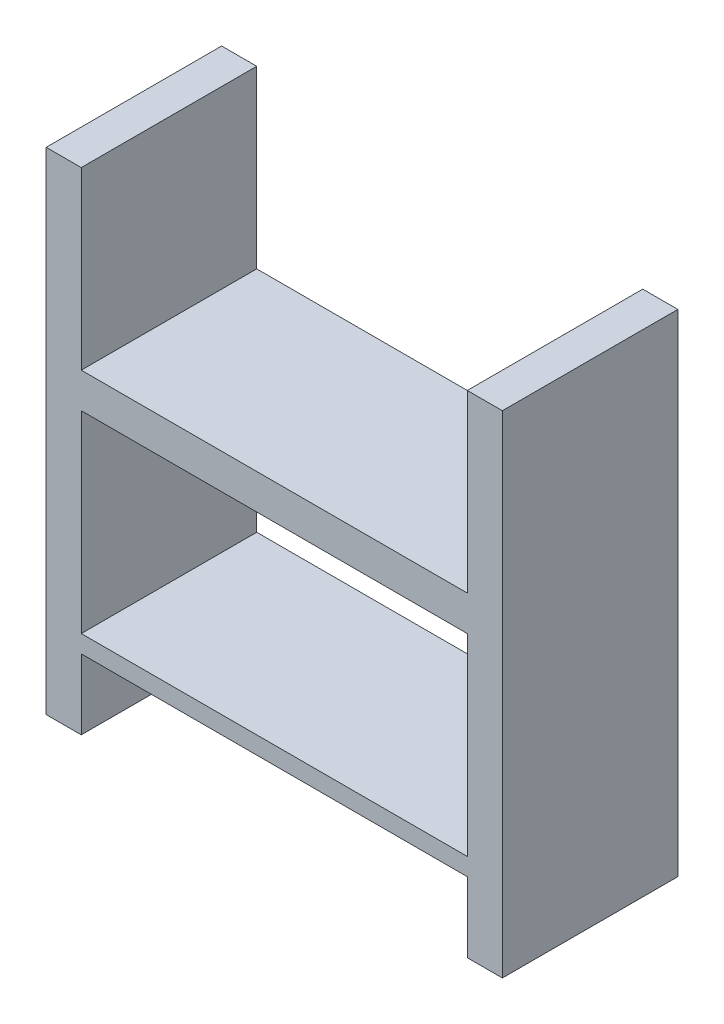
ISO-10303-21;
HEADER;
FILE_DESCRIPTION(('STEP AP214'),'2;1');
FILE_NAME('part.step','',(''),(''),'','','');
FILE_SCHEMA(('AUTOMOTIVE_DESIGN { 1 0 10303 214 1 1 1 1 }'));
ENDSEC;
DATA;
#1=APPLICATION_CONTEXT('core data for automotive mechanical design processes');
#2=APPLICATION_PROTOCOL_DEFINITION('international standard','automotive_design',2000,#1);
#3=PRODUCT_CONTEXT('',#1,'mechanical');
#4=PRODUCT('Part','Part','',(#3));
#5=PRODUCT_RELATED_PRODUCT_CATEGORY('part','',(#4));
#6=PRODUCT_DEFINITION_FORMATION('','',#4);
#7=PRODUCT_DEFINITION_CONTEXT('part definition',#1,'design');
#8=PRODUCT_DEFINITION('design','',#6,#7);
#9=PRODUCT_DEFINITION_SHAPE('','',#8);
#10=(LENGTH_UNIT() NAMED_UNIT(*) SI_UNIT(.MILLI.,.METRE.));
#11=(NAMED_UNIT(*) PLANE_ANGLE_UNIT() SI_UNIT($,.RADIAN.));
#12=(NAMED_UNIT(*) SI_UNIT($,.STERADIAN.) SOLID_ANGLE_UNIT());
#13=UNCERTAINTY_MEASURE_WITH_UNIT(LENGTH_MEASURE(1.E-05),#10,'distance_accuracy_value','');
#14=(GEOMETRIC_REPRESENTATION_CONTEXT(3) GLOBAL_UNCERTAINTY_ASSIGNED_CONTEXT((#13)) GLOBAL_UNIT_ASSIGNED_CONTEXT((#10,
#11,#12)) REPRESENTATION_CONTEXT('',''));
#15=CARTESIAN_POINT('',(0.,0.,0.));
#16=DIRECTION('',(0.,0.,1.));
#17=DIRECTION('',(1.,0.,0.));
#18=AXIS2_PLACEMENT_3D('',#15,#16,#17);
#19=CARTESIAN_POINT('',(55.,0.,50.));
#20=DIRECTION('',(-1.,0.,0.));
#21=DIRECTION('',(0.,0.,1.));
#22=AXIS2_PLACEMENT_3D('',#19,#20,#21);
#23=PLANE('',#22);
#24=DIRECTION('',(0.,1.,0.));
#25=VECTOR('',#24,1.);
#26=CARTESIAN_POINT('',(55.,0.,0.));
#27=LINE('',#26,#25);
#28=CARTESIAN_POINT('',(55.,-45.,0.));
#29=VERTEX_POINT('',#28);
#30=CARTESIAN_POINT('',(55.,-25.,0.));
#31=VERTEX_POINT('',#30);
#32=EDGE_CURVE('E275',#29,#31,#27,.T.);
#33=ORIENTED_EDGE('',*,*,#32,.F.);
#34=DIRECTION('',(0.,0.,-1.));
#35=VECTOR('',#34,1.);
#36=CARTESIAN_POINT('',(55.,-45.,50.));
#37=LINE('',#36,#35);
#38=CARTESIAN_POINT('',(55.,-45.,50.));
#39=VERTEX_POINT('',#38);
#40=EDGE_CURVE('E11',#39,#29,#37,.T.);
#41=ORIENTED_EDGE('',*,*,#40,.F.);
#42=DIRECTION('',(0.,1.,0.));
#43=VECTOR('',#42,1.);
#44=CARTESIAN_POINT('',(55.,0.,50.));
#45=LINE('',#44,#43);
#46=CARTESIAN_POINT('',(55.,-25.,50.));
#47=VERTEX_POINT('',#46);
#48=EDGE_CURVE('E322',#39,#47,#45,.T.);
#49=ORIENTED_EDGE('',*,*,#48,.T.);
#50=DIRECTION('',(0.,0.,-1.));
#51=VECTOR('',#50,1.);
#52=CARTESIAN_POINT('',(55.,-25.,50.));
#53=LINE('',#52,#51);
#54=EDGE_CURVE('E119',#47,#31,#53,.T.);
#55=ORIENTED_EDGE('',*,*,#54,.T.);
#56=EDGE_LOOP('',(#33,#41,#49,#55));
#57=FACE_BOUND('',#56,.T.);
#58=ADVANCED_FACE('F41',(#57),#23,.T.);
#59=CARTESIAN_POINT('',(0.,-45.,50.));
#60=DIRECTION('',(0.,1.,0.));
#61=DIRECTION('',(0.,0.,1.));
#62=AXIS2_PLACEMENT_3D('',#59,#60,#61);
#63=PLANE('',#62);
#64=DIRECTION('',(1.,0.,0.));
#65=VECTOR('',#64,1.);
#66=CARTESIAN_POINT('',(0.,-45.,0.));
#67=LINE('',#66,#65);
#68=CARTESIAN_POINT('',(65.,-45.,0.));
#69=VERTEX_POINT('',#68);
#70=EDGE_CURVE('E271',#29,#69,#67,.T.);
#71=ORIENTED_EDGE('',*,*,#70,.T.);
#72=DIRECTION('',(0.,0.,-1.));
#73=VECTOR('',#72,1.);
#74=CARTESIAN_POINT('',(65.,-45.,50.));
#75=LINE('',#74,#73);
#76=CARTESIAN_POINT('',(65.,-45.,50.));
#77=VERTEX_POINT('',#76);
#78=EDGE_CURVE('E52',#77,#69,#75,.T.);
#79=ORIENTED_EDGE('',*,*,#78,.F.);
#80=DIRECTION('',(1.,0.,0.));
#81=VECTOR('',#80,1.);
#82=CARTESIAN_POINT('',(0.,-45.,50.));
#83=LINE('',#82,#81);
#84=EDGE_CURVE('E319',#39,#77,#83,.T.);
#85=ORIENTED_EDGE('',*,*,#84,.F.);
#86=ORIENTED_EDGE('',*,*,#40,.T.);
#87=EDGE_LOOP('',(#71,#79,#85,#86));
#88=FACE_BOUND('',#87,.T.);
#89=ADVANCED_FACE('F357',(#88),#63,.F.);
#90=CARTESIAN_POINT('',(65.,0.,50.));
#91=DIRECTION('',(1.,0.,0.));
#92=DIRECTION('',(0.,0.,-1.));
#93=AXIS2_PLACEMENT_3D('',#90,#91,#92);
#94=PLANE('',#93);
#95=DIRECTION('',(0.,-1.,0.));
#96=VECTOR('',#95,1.);
#97=CARTESIAN_POINT('',(65.,0.,0.));
#98=LINE('',#97,#96);
#99=CARTESIAN_POINT('',(65.,95.,0.));
#100=VERTEX_POINT('',#99);
#101=EDGE_CURVE('E267',#100,#69,#98,.T.);
#102=ORIENTED_EDGE('',*,*,#101,.F.);
#103=DIRECTION('',(0.,0.,-1.));
#104=VECTOR('',#103,1.);
#105=CARTESIAN_POINT('',(65.,95.,50.));
#106=LINE('',#105,#104);
#107=CARTESIAN_POINT('',(65.,95.,50.));
#108=VERTEX_POINT('',#107);
#109=EDGE_CURVE('E214',#108,#100,#106,.T.);
#110=ORIENTED_EDGE('',*,*,#109,.F.);
#111=DIRECTION('',(0.,-1.,0.));
#112=VECTOR('',#111,1.);
#113=CARTESIAN_POINT('',(65.,0.,50.));
#114=LINE('',#113,#112);
#115=EDGE_CURVE('E315',#108,#77,#114,.T.);
#116=ORIENTED_EDGE('',*,*,#115,.T.);
#117=ORIENTED_EDGE('',*,*,#78,.T.);
#118=EDGE_LOOP('',(#102,#110,#116,#117));
#119=FACE_BOUND('',#118,.T.);
#120=ADVANCED_FACE('F362',(#119),#94,.T.);
#121=CARTESIAN_POINT('',(0.,95.,50.));
#122=DIRECTION('',(0.,1.,0.));
#123=DIRECTION('',(0.,0.,1.));
#124=AXIS2_PLACEMENT_3D('',#121,#122,#123);
#125=PLANE('',#124);
#126=DIRECTION('',(1.,0.,0.));
#127=VECTOR('',#126,1.);
#128=CARTESIAN_POINT('',(0.,95.,0.));
#129=LINE('',#128,#127);
#130=CARTESIAN_POINT('',(55.,95.,0.));
#131=VERTEX_POINT('',#130);
#132=EDGE_CURVE('E263',#131,#100,#129,.T.);
#133=ORIENTED_EDGE('',*,*,#132,.F.);
#134=DIRECTION('',(0.,0.,-1.));
#135=VECTOR('',#134,1.);
#136=CARTESIAN_POINT('',(55.,95.,50.));
#137=LINE('',#136,#135);
#138=CARTESIAN_POINT('',(55.,95.,50.));
#139=VERTEX_POINT('',#138);
#140=EDGE_CURVE('E211',#139,#131,#137,.T.);
#141=ORIENTED_EDGE('',*,*,#140,.F.);
#142=DIRECTION('',(1.,0.,0.));
#143=VECTOR('',#142,1.);
#144=CARTESIAN_POINT('',(0.,95.,50.));
#145=LINE('',#144,#143);
#146=EDGE_CURVE('E311',#139,#108,#145,.T.);
#147=ORIENTED_EDGE('',*,*,#146,.T.);
#148=ORIENTED_EDGE('',*,*,#109,.T.);
#149=EDGE_LOOP('',(#133,#141,#147,#148));
#150=FACE_BOUND('',#149,.T.);
#151=ADVANCED_FACE('F368',(#150),#125,.T.);
#152=CARTESIAN_POINT('',(55.,0.,50.));
#153=DIRECTION('',(-1.,0.,0.));
#154=DIRECTION('',(0.,-1.,0.));
#155=AXIS2_PLACEMENT_3D('',#152,#153,#154);
#156=PLANE('',#155);
#157=DIRECTION('',(0.,1.,0.));
#158=VECTOR('',#157,1.);
#159=CARTESIAN_POINT('',(55.,0.,0.));
#160=LINE('',#159,#158);
#161=CARTESIAN_POINT('',(55.,45.,0.));
#162=VERTEX_POINT('',#161);
#163=EDGE_CURVE('E259',#162,#131,#160,.T.);
#164=ORIENTED_EDGE('',*,*,#163,.F.);
#165=DIRECTION('',(0.,0.,-1.));
#166=VECTOR('',#165,1.);
#167=CARTESIAN_POINT('',(55.,45.,50.));
#168=LINE('',#167,#166);
#169=CARTESIAN_POINT('',(55.,45.,50.));
#170=VERTEX_POINT('',#169);
#171=EDGE_CURVE('E208',#170,#162,#168,.T.);
#172=ORIENTED_EDGE('',*,*,#171,.F.);
#173=DIRECTION('',(0.,1.,0.));
#174=VECTOR('',#173,1.);
#175=CARTESIAN_POINT('',(55.,0.,50.));
#176=LINE('',#175,#174);
#177=EDGE_CURVE('E307',#170,#139,#176,.T.);
#178=ORIENTED_EDGE('',*,*,#177,.T.);
#179=ORIENTED_EDGE('',*,*,#140,.T.);
#180=EDGE_LOOP('',(#164,#172,#178,#179));
#181=FACE_BOUND('',#180,.T.);
#182=ADVANCED_FACE('F372',(#181),#156,.T.);
#183=CARTESIAN_POINT('',(0.,45.,50.));
#184=DIRECTION('',(0.,1.,0.));
#185=DIRECTION('',(0.,0.,1.));
#186=AXIS2_PLACEMENT_3D('',#183,#184,#185);
#187=PLANE('',#186);
#188=DIRECTION('',(1.,0.,0.));
#189=VECTOR('',#188,1.);
#190=CARTESIAN_POINT('',(0.,45.,0.));
#191=LINE('',#190,#189);
#192=CARTESIAN_POINT('',(-55.,45.,0.));
#193=VERTEX_POINT('',#192);
#194=EDGE_CURVE('E255',#193,#162,#191,.T.);
#195=ORIENTED_EDGE('',*,*,#194,.F.);
#196=DIRECTION('',(0.,0.,-1.));
#197=VECTOR('',#196,1.);
#198=CARTESIAN_POINT('',(-55.,45.,50.));
#199=LINE('',#198,#197);
#200=CARTESIAN_POINT('',(-55.,45.,50.));
#201=VERTEX_POINT('',#200);
#202=EDGE_CURVE('E205',#201,#193,#199,.T.);
#203=ORIENTED_EDGE('',*,*,#202,.F.);
#204=DIRECTION('',(1.,0.,0.));
#205=VECTOR('',#204,1.);
#206=CARTESIAN_POINT('',(0.,45.,50.));
#207=LINE('',#206,#205);
#208=EDGE_CURVE('E303',#201,#170,#207,.T.);
#209=ORIENTED_EDGE('',*,*,#208,.T.);
#210=ORIENTED_EDGE('',*,*,#171,.T.);
#211=EDGE_LOOP('',(#195,#203,#209,#210));
#212=FACE_BOUND('',#211,.T.);
#213=ADVANCED_FACE('F376',(#212),#187,.T.);
#214=CARTESIAN_POINT('',(-55.,0.,50.));
#215=DIRECTION('',(-1.,0.,0.));
#216=DIRECTION('',(0.,0.,1.));
#217=AXIS2_PLACEMENT_3D('',#214,#215,#216);
#218=PLANE('',#217);
#219=DIRECTION('',(0.,1.,0.));
#220=VECTOR('',#219,1.);
#221=CARTESIAN_POINT('',(-55.,0.,0.));
#222=LINE('',#221,#220);
#223=CARTESIAN_POINT('',(-55.,95.,0.));
#224=VERTEX_POINT('',#223);
#225=EDGE_CURVE('E251',#193,#224,#222,.T.);
#226=ORIENTED_EDGE('',*,*,#225,.T.);
#227=DIRECTION('',(0.,0.,-1.));
#228=VECTOR('',#227,1.);
#229=CARTESIAN_POINT('',(-55.,95.,50.));
#230=LINE('',#229,#228);
#231=CARTESIAN_POINT('',(-55.,95.,50.));
#232=VERTEX_POINT('',#231);
#233=EDGE_CURVE('E202',#232,#224,#230,.T.);
#234=ORIENTED_EDGE('',*,*,#233,.F.);
#235=DIRECTION('',(0.,1.,0.));
#236=VECTOR('',#235,1.);
#237=CARTESIAN_POINT('',(-55.,0.,50.));
#238=LINE('',#237,#236);
#239=EDGE_CURVE('E300',#201,#232,#238,.T.);
#240=ORIENTED_EDGE('',*,*,#239,.F.);
#241=ORIENTED_EDGE('',*,*,#202,.T.);
#242=EDGE_LOOP('',(#226,#234,#240,#241));
#243=FACE_BOUND('',#242,.T.);
#244=ADVANCED_FACE('F380',(#243),#218,.F.);
#245=CARTESIAN_POINT('',(0.,95.,50.));
#246=DIRECTION('',(0.,1.,0.));
#247=DIRECTION('',(0.,0.,1.));
#248=AXIS2_PLACEMENT_3D('',#245,#246,#247);
#249=PLANE('',#248);
#250=DIRECTION('',(1.,0.,0.));
#251=VECTOR('',#250,1.);
#252=CARTESIAN_POINT('',(0.,95.,0.));
#253=LINE('',#252,#251);
#254=CARTESIAN_POINT('',(-65.,95.,0.));
#255=VERTEX_POINT('',#254);
#256=EDGE_CURVE('E247',#255,#224,#253,.T.);
#257=ORIENTED_EDGE('',*,*,#256,.F.);
#258=DIRECTION('',(0.,0.,-1.));
#259=VECTOR('',#258,1.);
#260=CARTESIAN_POINT('',(-65.,95.,50.));
#261=LINE('',#260,#259);
#262=CARTESIAN_POINT('',(-65.,95.,50.));
#263=VERTEX_POINT('',#262);
#264=EDGE_CURVE('E195',#263,#255,#261,.T.);
#265=ORIENTED_EDGE('',*,*,#264,.F.);
#266=DIRECTION('',(1.,0.,0.));
#267=VECTOR('',#266,1.);
#268=CARTESIAN_POINT('',(0.,95.,50.));
#269=LINE('',#268,#267);
#270=EDGE_CURVE('E296',#263,#232,#269,.T.);
#271=ORIENTED_EDGE('',*,*,#270,.T.);
#272=ORIENTED_EDGE('',*,*,#233,.T.);
#273=EDGE_LOOP('',(#257,#265,#271,#272));
#274=FACE_BOUND('',#273,.T.);
#275=ADVANCED_FACE('F384',(#274),#249,.T.);
#276=CARTESIAN_POINT('',(-65.,0.,50.));
#277=DIRECTION('',(-1.,0.,0.));
#278=DIRECTION('',(0.,0.,1.));
#279=AXIS2_PLACEMENT_3D('',#276,#277,#278);
#280=PLANE('',#279);
#281=DIRECTION('',(0.,1.,0.));
#282=VECTOR('',#281,1.);
#283=CARTESIAN_POINT('',(-65.,0.,0.));
#284=LINE('',#283,#282);
#285=CARTESIAN_POINT('',(-65.,-45.,0.));
#286=VERTEX_POINT('',#285);
#287=EDGE_CURVE('E243',#286,#255,#284,.T.);
#288=ORIENTED_EDGE('',*,*,#287,.F.);
#289=DIRECTION('',(0.,0.,-1.));
#290=VECTOR('',#289,1.);
#291=CARTESIAN_POINT('',(-65.,-45.,50.));
#292=LINE('',#291,#290);
#293=CARTESIAN_POINT('',(-65.,-45.,50.));
#294=VERTEX_POINT('',#293);
#295=EDGE_CURVE('E191',#294,#286,#292,.T.);
#296=ORIENTED_EDGE('',*,*,#295,.F.);
#297=DIRECTION('',(0.,1.,0.));
#298=VECTOR('',#297,1.);
#299=CARTESIAN_POINT('',(-65.,0.,50.));
#300=LINE('',#299,#298);
#301=EDGE_CURVE('E183',#294,#263,#300,.T.);
#302=ORIENTED_EDGE('',*,*,#301,.T.);
#303=ORIENTED_EDGE('',*,*,#264,.T.);
#304=EDGE_LOOP('',(#288,#296,#302,#303));
#305=FACE_BOUND('',#304,.T.);
#306=ADVANCED_FACE('F388',(#305),#280,.T.);
#307=CARTESIAN_POINT('',(0.,-45.,50.));
#308=DIRECTION('',(0.,1.,0.));
#309=DIRECTION('',(0.,0.,1.));
#310=AXIS2_PLACEMENT_3D('',#307,#308,#309);
#311=PLANE('',#310);
#312=DIRECTION('',(1.,0.,0.));
#313=VECTOR('',#312,1.);
#314=CARTESIAN_POINT('',(0.,-45.,0.));
#315=LINE('',#314,#313);
#316=CARTESIAN_POINT('',(-55.,-45.,0.));
#317=VERTEX_POINT('',#316);
#318=EDGE_CURVE('E189',#286,#317,#315,.T.);
#319=ORIENTED_EDGE('',*,*,#318,.T.);
#320=DIRECTION('',(0.,0.,-1.));
#321=VECTOR('',#320,1.);
#322=CARTESIAN_POINT('',(-55.,-45.,50.));
#323=LINE('',#322,#321);
#324=CARTESIAN_POINT('',(-55.,-45.,50.));
#325=VERTEX_POINT('',#324);
#326=EDGE_CURVE('E172',#325,#317,#323,.T.);
#327=ORIENTED_EDGE('',*,*,#326,.F.);
#328=DIRECTION('',(1.,0.,0.));
#329=VECTOR('',#328,1.);
#330=CARTESIAN_POINT('',(0.,-45.,50.));
#331=LINE('',#330,#329);
#332=EDGE_CURVE('E176',#294,#325,#331,.T.);
#333=ORIENTED_EDGE('',*,*,#332,.F.);
#334=ORIENTED_EDGE('',*,*,#295,.T.);
#335=EDGE_LOOP('',(#319,#327,#333,#334));
#336=FACE_BOUND('',#335,.T.);
#337=ADVANCED_FACE('F187',(#336),#311,.F.);
#338=CARTESIAN_POINT('',(-55.,0.,50.));
#339=DIRECTION('',(-1.,0.,0.));
#340=DIRECTION('',(0.,0.,1.));
#341=AXIS2_PLACEMENT_3D('',#338,#339,#340);
#342=PLANE('',#341);
#343=DIRECTION('',(0.,1.,0.));
#344=VECTOR('',#343,1.);
#345=CARTESIAN_POINT('',(-55.,0.,0.));
#346=LINE('',#345,#344);
#347=CARTESIAN_POINT('',(-55.,-25.,0.));
#348=VERTEX_POINT('',#347);
#349=EDGE_CURVE('E238',#317,#348,#346,.T.);
#350=ORIENTED_EDGE('',*,*,#349,.T.);
#351=DIRECTION('',(0.,0.,-1.));
#352=VECTOR('',#351,1.);
#353=CARTESIAN_POINT('',(-55.,-25.,50.));
#354=LINE('',#353,#352);
#355=CARTESIAN_POINT('',(-55.,-25.,50.));
#356=VERTEX_POINT('',#355);
#357=EDGE_CURVE('E174',#356,#348,#354,.T.);
#358=ORIENTED_EDGE('',*,*,#357,.F.);
#359=DIRECTION('',(0.,1.,0.));
#360=VECTOR('',#359,1.);
#361=CARTESIAN_POINT('',(-55.,0.,50.));
#362=LINE('',#361,#360);
#363=EDGE_CURVE('E167',#325,#356,#362,.T.);
#364=ORIENTED_EDGE('',*,*,#363,.F.);
#365=ORIENTED_EDGE('',*,*,#326,.T.);
#366=EDGE_LOOP('',(#350,#358,#364,#365));
#367=FACE_BOUND('',#366,.T.);
#368=ADVANCED_FACE('F170',(#367),#342,.F.);
#369=CARTESIAN_POINT('',(-55.,0.,50.));
#370=DIRECTION('',(-1.,0.,0.));
#371=DIRECTION('',(0.,0.,1.));
#372=AXIS2_PLACEMENT_3D('',#369,#370,#371);
#373=PLANE('',#372);
#374=DIRECTION('',(0.,1.,0.));
#375=VECTOR('',#374,1.);
#376=CARTESIAN_POINT('',(-55.,0.,0.));
#377=LINE('',#376,#375);
#378=CARTESIAN_POINT('',(-55.,-20.,0.));
#379=VERTEX_POINT('',#378);
#380=CARTESIAN_POINT('',(-55.,35.,0.));
#381=VERTEX_POINT('',#380);
#382=EDGE_CURVE('E289',#379,#381,#377,.T.);
#383=ORIENTED_EDGE('',*,*,#382,.T.);
#384=DIRECTION('',(0.,0.,-1.));
#385=VECTOR('',#384,1.);
#386=CARTESIAN_POINT('',(-55.,35.,50.));
#387=LINE('',#386,#385);
#388=CARTESIAN_POINT('',(-55.,35.,50.));
#389=VERTEX_POINT('',#388);
#390=EDGE_CURVE('E45',#389,#381,#387,.T.);
#391=ORIENTED_EDGE('',*,*,#390,.F.);
#392=DIRECTION('',(0.,1.,0.));
#393=VECTOR('',#392,1.);
#394=CARTESIAN_POINT('',(-55.,0.,50.));
#395=LINE('',#394,#393);
#396=CARTESIAN_POINT('',(-55.,-20.,50.));
#397=VERTEX_POINT('',#396);
#398=EDGE_CURVE('E237',#397,#389,#395,.T.);
#399=ORIENTED_EDGE('',*,*,#398,.F.);
#400=DIRECTION('',(0.,0.,-1.));
#401=VECTOR('',#400,1.);
#402=CARTESIAN_POINT('',(-55.,-20.,50.));
#403=LINE('',#402,#401);
#404=EDGE_CURVE('E219',#397,#379,#403,.T.);
#405=ORIENTED_EDGE('',*,*,#404,.T.);
#406=EDGE_LOOP('',(#383,#391,#399,#405));
#407=FACE_BOUND('',#406,.T.);
#408=ADVANCED_FACE('F43',(#407),#373,.F.);
#409=CARTESIAN_POINT('',(0.,35.,50.));
#410=DIRECTION('',(0.,1.,0.));
#411=DIRECTION('',(0.,0.,1.));
#412=AXIS2_PLACEMENT_3D('',#409,#410,#411);
#413=PLANE('',#412);
#414=DIRECTION('',(1.,0.,0.));
#415=VECTOR('',#414,1.);
#416=CARTESIAN_POINT('',(0.,35.,0.));
#417=LINE('',#416,#415);
#418=CARTESIAN_POINT('',(55.,35.,0.));
#419=VERTEX_POINT('',#418);
#420=EDGE_CURVE('E286',#381,#419,#417,.T.);
#421=ORIENTED_EDGE('',*,*,#420,.T.);
#422=DIRECTION('',(0.,0.,-1.));
#423=VECTOR('',#422,1.);
#424=CARTESIAN_POINT('',(55.,35.,50.));
#425=LINE('',#424,#423);
#426=CARTESIAN_POINT('',(55.,35.,50.));
#427=VERTEX_POINT('',#426);
#428=EDGE_CURVE('E224',#427,#419,#425,.T.);
#429=ORIENTED_EDGE('',*,*,#428,.F.);
#430=DIRECTION('',(1.,0.,0.));
#431=VECTOR('',#430,1.);
#432=CARTESIAN_POINT('',(0.,35.,50.));
#433=LINE('',#432,#431);
#434=EDGE_CURVE('E127',#389,#427,#433,.T.);
#435=ORIENTED_EDGE('',*,*,#434,.F.);
#436=ORIENTED_EDGE('',*,*,#390,.T.);
#437=EDGE_LOOP('',(#421,#429,#435,#436));
#438=FACE_BOUND('',#437,.T.);
#439=ADVANCED_FACE('F348',(#438),#413,.F.);
#440=CARTESIAN_POINT('',(55.,0.,50.));
#441=DIRECTION('',(-1.,0.,0.));
#442=DIRECTION('',(0.,-1.,0.));
#443=AXIS2_PLACEMENT_3D('',#440,#441,#442);
#444=PLANE('',#443);
#445=DIRECTION('',(0.,1.,0.));
#446=VECTOR('',#445,1.);
#447=CARTESIAN_POINT('',(55.,0.,0.));
#448=LINE('',#447,#446);
#449=CARTESIAN_POINT('',(55.,-20.,0.));
#450=VERTEX_POINT('',#449);
#451=EDGE_CURVE('E282',#450,#419,#448,.T.);
#452=ORIENTED_EDGE('',*,*,#451,.F.);
#453=DIRECTION('',(0.,0.,-1.));
#454=VECTOR('',#453,1.);
#455=CARTESIAN_POINT('',(55.,-20.,50.));
#456=LINE('',#455,#454);
#457=CARTESIAN_POINT('',(55.,-20.,50.));
#458=VERTEX_POINT('',#457);
#459=EDGE_CURVE('E222',#458,#450,#456,.T.);
#460=ORIENTED_EDGE('',*,*,#459,.F.);
#461=DIRECTION('',(0.,1.,0.));
#462=VECTOR('',#461,1.);
#463=CARTESIAN_POINT('',(55.,0.,50.));
#464=LINE('',#463,#462);
#465=EDGE_CURVE('E329',#458,#427,#464,.T.);
#466=ORIENTED_EDGE('',*,*,#465,.T.);
#467=ORIENTED_EDGE('',*,*,#428,.T.);
#468=EDGE_LOOP('',(#452,#460,#466,#467));
#469=FACE_BOUND('',#468,.T.);
#470=ADVANCED_FACE('F346',(#469),#444,.T.);
#471=CARTESIAN_POINT('',(0.,-20.,50.));
#472=DIRECTION('',(0.,1.,0.));
#473=DIRECTION('',(0.,0.,1.));
#474=AXIS2_PLACEMENT_3D('',#471,#472,#473);
#475=PLANE('',#474);
#476=DIRECTION('',(1.,0.,0.));
#477=VECTOR('',#476,1.);
#478=CARTESIAN_POINT('',(0.,-20.,0.));
#479=LINE('',#478,#477);
#480=EDGE_CURVE('E278',#379,#450,#479,.T.);
#481=ORIENTED_EDGE('',*,*,#480,.F.);
#482=ORIENTED_EDGE('',*,*,#404,.F.);
#483=DIRECTION('',(1.,0.,0.));
#484=VECTOR('',#483,1.);
#485=CARTESIAN_POINT('',(0.,-20.,50.));
#486=LINE('',#485,#484);
#487=EDGE_CURVE('E325',#397,#458,#486,.T.);
#488=ORIENTED_EDGE('',*,*,#487,.T.);
#489=ORIENTED_EDGE('',*,*,#459,.T.);
#490=EDGE_LOOP('',(#481,#482,#488,#489));
#491=FACE_BOUND('',#490,.T.);
#492=ADVANCED_FACE('F345',(#491),#475,.T.);
#493=CARTESIAN_POINT('',(0.,-25.,50.));
#494=DIRECTION('',(0.,1.,0.));
#495=DIRECTION('',(0.,0.,1.));
#496=AXIS2_PLACEMENT_3D('',#493,#494,#495);
#497=PLANE('',#496);
#498=DIRECTION('',(1.,0.,0.));
#499=VECTOR('',#498,1.);
#500=CARTESIAN_POINT('',(0.,-25.,0.));
#501=LINE('',#500,#499);
#502=EDGE_CURVE('E112',#348,#31,#501,.T.);
#503=ORIENTED_EDGE('',*,*,#502,.T.);
#504=ORIENTED_EDGE('',*,*,#54,.F.);
#505=DIRECTION('',(1.,0.,0.));
#506=VECTOR('',#505,1.);
#507=CARTESIAN_POINT('',(0.,-25.,50.));
#508=LINE('',#507,#506);
#509=EDGE_CURVE('E61',#356,#47,#508,.T.);
#510=ORIENTED_EDGE('',*,*,#509,.F.);
#511=ORIENTED_EDGE('',*,*,#357,.T.);
#512=EDGE_LOOP('',(#503,#504,#510,#511));
#513=FACE_BOUND('',#512,.T.);
#514=ADVANCED_FACE('F354',(#513),#497,.F.);
#515=CARTESIAN_POINT('',(0.,0.,50.));
#516=DIRECTION('',(0.,0.,1.));
#517=DIRECTION('',(1.,0.,0.));
#518=AXIS2_PLACEMENT_3D('',#515,#516,#517);
#519=PLANE('',#518);
#520=ORIENTED_EDGE('',*,*,#398,.T.);
#521=ORIENTED_EDGE('',*,*,#434,.T.);
#522=ORIENTED_EDGE('',*,*,#465,.F.);
#523=ORIENTED_EDGE('',*,*,#487,.F.);
#524=EDGE_LOOP('',(#520,#521,#522,#523));
#525=FACE_BOUND('',#524,.T.);
#526=ORIENTED_EDGE('',*,*,#48,.F.);
#527=ORIENTED_EDGE('',*,*,#84,.T.);
#528=ORIENTED_EDGE('',*,*,#115,.F.);
#529=ORIENTED_EDGE('',*,*,#146,.F.);
#530=ORIENTED_EDGE('',*,*,#177,.F.);
#531=ORIENTED_EDGE('',*,*,#208,.F.);
#532=ORIENTED_EDGE('',*,*,#239,.T.);
#533=ORIENTED_EDGE('',*,*,#270,.F.);
#534=ORIENTED_EDGE('',*,*,#301,.F.);
#535=ORIENTED_EDGE('',*,*,#332,.T.);
#536=ORIENTED_EDGE('',*,*,#363,.T.);
#537=ORIENTED_EDGE('',*,*,#509,.T.);
#538=EDGE_LOOP('',(#526,#527,#528,#529,#530,#531,#532,#533,#534,#535,#536,#537));
#539=FACE_BOUND('',#538,.T.);
#540=ADVANCED_FACE('F180',(#525,#539),#519,.T.);
#541=CARTESIAN_POINT('',(0.,0.,0.));
#542=DIRECTION('',(0.,0.,1.));
#543=DIRECTION('',(1.,0.,0.));
#544=AXIS2_PLACEMENT_3D('',#541,#542,#543);
#545=PLANE('',#544);
#546=ORIENTED_EDGE('',*,*,#382,.F.);
#547=ORIENTED_EDGE('',*,*,#480,.T.);
#548=ORIENTED_EDGE('',*,*,#451,.T.);
#549=ORIENTED_EDGE('',*,*,#420,.F.);
#550=EDGE_LOOP('',(#546,#547,#548,#549));
#551=FACE_BOUND('',#550,.T.);
#552=ORIENTED_EDGE('',*,*,#32,.T.);
#553=ORIENTED_EDGE('',*,*,#502,.F.);
#554=ORIENTED_EDGE('',*,*,#349,.F.);
#555=ORIENTED_EDGE('',*,*,#318,.F.);
#556=ORIENTED_EDGE('',*,*,#287,.T.);
#557=ORIENTED_EDGE('',*,*,#256,.T.);
#558=ORIENTED_EDGE('',*,*,#225,.F.);
#559=ORIENTED_EDGE('',*,*,#194,.T.);
#560=ORIENTED_EDGE('',*,*,#163,.T.);
#561=ORIENTED_EDGE('',*,*,#132,.T.);
#562=ORIENTED_EDGE('',*,*,#101,.T.);
#563=ORIENTED_EDGE('',*,*,#70,.F.);
#564=EDGE_LOOP('',(#552,#553,#554,#555,#556,#557,#558,#559,#560,#561,#562,#563));
#565=FACE_BOUND('',#564,.T.);
#566=ADVANCED_FACE('F343',(#551,#565),#545,.F.);
#567=CLOSED_SHELL('',(#58,#89,#120,#151,#182,#213,#244,#275,#306,#337,#368,#408,#439,#470,#492,
#514,#540,#566));
#568=MANIFOLD_SOLID_BREP('B2',#567);
#569=ADVANCED_BREP_SHAPE_REPRESENTATION('',(#18,#568),#14);
#570=SHAPE_DEFINITION_REPRESENTATION(#9,#569);
ENDSEC;
END-ISO-10303-21;
